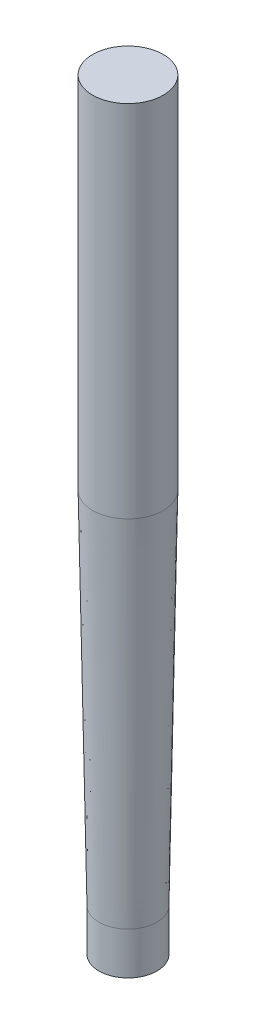
ISO-10303-21;
HEADER;
FILE_DESCRIPTION(('STEP AP214'),'2;1');
FILE_NAME('part.step','',(''),(''),'','','');
FILE_SCHEMA(('AUTOMOTIVE_DESIGN { 1 0 10303 214 1 1 1 1 }'));
ENDSEC;
DATA;
#1=APPLICATION_CONTEXT('core data for automotive mechanical design processes');
#2=APPLICATION_PROTOCOL_DEFINITION('international standard','automotive_design',2000,#1);
#3=PRODUCT_CONTEXT('',#1,'mechanical');
#4=PRODUCT('Part','Part','',(#3));
#5=PRODUCT_RELATED_PRODUCT_CATEGORY('part','',(#4));
#6=PRODUCT_DEFINITION_FORMATION('','',#4);
#7=PRODUCT_DEFINITION_CONTEXT('part definition',#1,'design');
#8=PRODUCT_DEFINITION('design','',#6,#7);
#9=PRODUCT_DEFINITION_SHAPE('','',#8);
#10=(LENGTH_UNIT() NAMED_UNIT(*) SI_UNIT(.MILLI.,.METRE.));
#11=(NAMED_UNIT(*) PLANE_ANGLE_UNIT() SI_UNIT($,.RADIAN.));
#12=(NAMED_UNIT(*) SI_UNIT($,.STERADIAN.) SOLID_ANGLE_UNIT());
#13=UNCERTAINTY_MEASURE_WITH_UNIT(LENGTH_MEASURE(1.E-05),#10,'distance_accuracy_value','');
#14=(GEOMETRIC_REPRESENTATION_CONTEXT(3) GLOBAL_UNCERTAINTY_ASSIGNED_CONTEXT((#13)) GLOBAL_UNIT_ASSIGNED_CONTEXT((#10,
#11,#12)) REPRESENTATION_CONTEXT('',''));
#15=CARTESIAN_POINT('',(0.,0.,0.));
#16=DIRECTION('',(0.,0.,1.));
#17=DIRECTION('',(1.,0.,0.));
#18=AXIS2_PLACEMENT_3D('',#15,#16,#17);
#19=CARTESIAN_POINT('',(0.,0.,0.));
#20=DIRECTION('',(0.,1.,0.));
#21=DIRECTION('',(0.,0.,1.));
#22=AXIS2_PLACEMENT_3D('',#19,#20,#21);
#23=CONICAL_SURFACE('',#22,6.85815974055074,0.0174532925199432);
#24=CARTESIAN_POINT('',(0.,85.,0.));
#25=DIRECTION('',(0.,1.,0.));
#26=DIRECTION('',(0.,0.,1.));
#27=AXIS2_PLACEMENT_3D('',#24,#25,#26);
#28=CIRCLE('',#27,8.34184025944923);
#29=CARTESIAN_POINT('',(0.,85.,8.34184025944923));
#30=VERTEX_POINT('',#29);
#31=EDGE_CURVE('E49',#30,#30,#28,.T.);
#32=ORIENTED_EDGE('',*,*,#31,.F.);
#33=EDGE_LOOP('',(#32));
#34=FACE_BOUND('',#33,.T.);
#35=CARTESIAN_POINT('',(0.,0.,0.));
#36=DIRECTION('',(0.,-1.,0.));
#37=DIRECTION('',(0.,0.,-1.));
#38=AXIS2_PLACEMENT_3D('',#35,#36,#37);
#39=CIRCLE('',#38,6.85815974055074);
#40=CARTESIAN_POINT('',(0.,0.,-6.85815974055074));
#41=VERTEX_POINT('',#40);
#42=EDGE_CURVE('E10',#41,#41,#39,.T.);
#43=ORIENTED_EDGE('',*,*,#42,.F.);
#44=EDGE_LOOP('',(#43));
#45=FACE_BOUND('',#44,.T.);
#46=ADVANCED_FACE('F39',(#34,#45),#23,.T.);
#47=CARTESIAN_POINT('',(0.,170.,0.));
#48=DIRECTION('',(0.,-1.,0.));
#49=DIRECTION('',(0.,0.,-1.));
#50=AXIS2_PLACEMENT_3D('',#47,#48,#49);
#51=CYLINDRICAL_SURFACE('',#50,8.34184025944923);
#52=CARTESIAN_POINT('',(0.,170.,0.));
#53=DIRECTION('',(0.,1.,0.));
#54=DIRECTION('',(0.,0.,1.));
#55=AXIS2_PLACEMENT_3D('',#52,#53,#54);
#56=CIRCLE('',#55,8.34184025944923);
#57=CARTESIAN_POINT('',(0.,170.,8.34184025944923));
#58=VERTEX_POINT('',#57);
#59=EDGE_CURVE('E45',#58,#58,#56,.T.);
#60=ORIENTED_EDGE('',*,*,#59,.F.);
#61=EDGE_LOOP('',(#60));
#62=FACE_BOUND('',#61,.T.);
#63=ORIENTED_EDGE('',*,*,#31,.T.);
#64=EDGE_LOOP('',(#63));
#65=FACE_BOUND('',#64,.T.);
#66=ADVANCED_FACE('F70',(#62,#65),#51,.T.);
#67=CARTESIAN_POINT('',(0.,170.,0.));
#68=DIRECTION('',(0.,1.,0.));
#69=DIRECTION('',(0.,0.,1.));
#70=AXIS2_PLACEMENT_3D('',#67,#68,#69);
#71=PLANE('',#70);
#72=ORIENTED_EDGE('',*,*,#59,.T.);
#73=EDGE_LOOP('',(#72));
#74=FACE_BOUND('',#73,.T.);
#75=ADVANCED_FACE('F63',(#74),#71,.T.);
#76=CARTESIAN_POINT('',(0.,-10.,0.));
#77=DIRECTION('',(0.,1.,0.));
#78=DIRECTION('',(0.,0.,1.));
#79=AXIS2_PLACEMENT_3D('',#76,#77,#78);
#80=CYLINDRICAL_SURFACE('',#79,6.85815974055074);
#81=CARTESIAN_POINT('',(0.,-10.,0.));
#82=DIRECTION('',(0.,-1.,0.));
#83=DIRECTION('',(0.,0.,-1.));
#84=AXIS2_PLACEMENT_3D('',#81,#82,#83);
#85=CIRCLE('',#84,6.85815974055074);
#86=CARTESIAN_POINT('',(0.,-10.,-6.85815974055074));
#87=VERTEX_POINT('',#86);
#88=EDGE_CURVE('E54',#87,#87,#85,.T.);
#89=ORIENTED_EDGE('',*,*,#88,.F.);
#90=EDGE_LOOP('',(#89));
#91=FACE_BOUND('',#90,.T.);
#92=ORIENTED_EDGE('',*,*,#42,.T.);
#93=EDGE_LOOP('',(#92));
#94=FACE_BOUND('',#93,.T.);
#95=ADVANCED_FACE('F61',(#91,#94),#80,.T.);
#96=CARTESIAN_POINT('',(0.,-10.,0.));
#97=DIRECTION('',(0.,-1.,0.));
#98=DIRECTION('',(0.,0.,-1.));
#99=AXIS2_PLACEMENT_3D('',#96,#97,#98);
#100=PLANE('',#99);
#101=ORIENTED_EDGE('',*,*,#88,.T.);
#102=EDGE_LOOP('',(#101));
#103=FACE_BOUND('',#102,.T.);
#104=ADVANCED_FACE('F59',(#103),#100,.T.);
#105=CLOSED_SHELL('',(#46,#66,#75,#95,#104));
#106=MANIFOLD_SOLID_BREP('B2',#105);
#107=ADVANCED_BREP_SHAPE_REPRESENTATION('',(#18,#106),#14);
#108=SHAPE_DEFINITION_REPRESENTATION(#9,#107);
ENDSEC;
END-ISO-10303-21;
